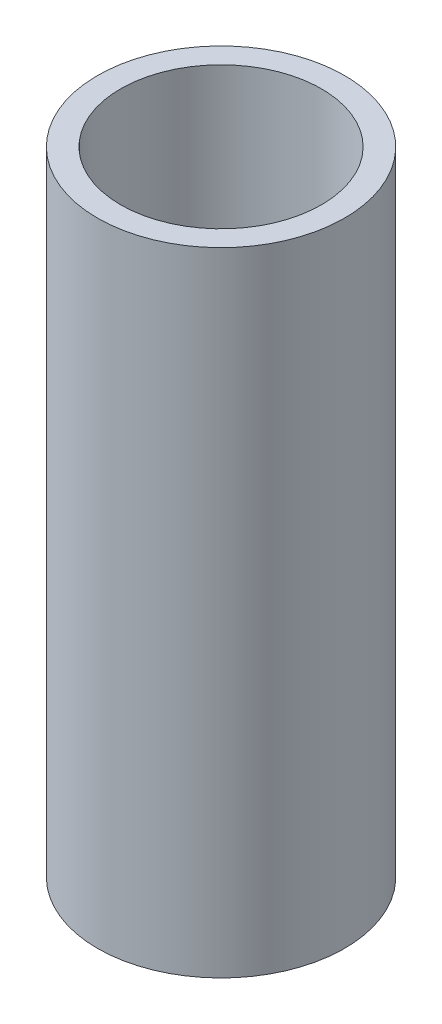
ISO-10303-21;
HEADER;
FILE_DESCRIPTION(('STEP AP214'),'2;1');
FILE_NAME('part.step','',(''),(''),'','','');
FILE_SCHEMA(('AUTOMOTIVE_DESIGN { 1 0 10303 214 1 1 1 1 }'));
ENDSEC;
DATA;
#1=APPLICATION_CONTEXT('core data for automotive mechanical design processes');
#2=APPLICATION_PROTOCOL_DEFINITION('international standard','automotive_design',2000,#1);
#3=PRODUCT_CONTEXT('',#1,'mechanical');
#4=PRODUCT('Part','Part','',(#3));
#5=PRODUCT_RELATED_PRODUCT_CATEGORY('part','',(#4));
#6=PRODUCT_DEFINITION_FORMATION('','',#4);
#7=PRODUCT_DEFINITION_CONTEXT('part definition',#1,'design');
#8=PRODUCT_DEFINITION('design','',#6,#7);
#9=PRODUCT_DEFINITION_SHAPE('','',#8);
#10=(LENGTH_UNIT() NAMED_UNIT(*) SI_UNIT(.MILLI.,.METRE.));
#11=(NAMED_UNIT(*) PLANE_ANGLE_UNIT() SI_UNIT($,.RADIAN.));
#12=(NAMED_UNIT(*) SI_UNIT($,.STERADIAN.) SOLID_ANGLE_UNIT());
#13=UNCERTAINTY_MEASURE_WITH_UNIT(LENGTH_MEASURE(1.E-05),#10,'distance_accuracy_value','');
#14=(GEOMETRIC_REPRESENTATION_CONTEXT(3) GLOBAL_UNCERTAINTY_ASSIGNED_CONTEXT((#13)) GLOBAL_UNIT_ASSIGNED_CONTEXT((#10,
#11,#12)) REPRESENTATION_CONTEXT('',''));
#15=CARTESIAN_POINT('',(0.,0.,0.));
#16=DIRECTION('',(0.,0.,1.));
#17=DIRECTION('',(1.,0.,0.));
#18=AXIS2_PLACEMENT_3D('',#15,#16,#17);
#19=CARTESIAN_POINT('',(0.,192.,0.));
#20=DIRECTION('',(0.,1.,0.));
#21=DIRECTION('',(0.,0.,1.));
#22=AXIS2_PLACEMENT_3D('',#19,#20,#21);
#23=PLANE('',#22);
#24=CARTESIAN_POINT('',(0.,192.,0.));
#25=DIRECTION('',(0.,1.,0.));
#26=DIRECTION('',(0.,0.,1.));
#27=AXIS2_PLACEMENT_3D('',#24,#25,#26);
#28=CIRCLE('',#27,37.5);
#29=CARTESIAN_POINT('',(0.,192.,37.5));
#30=VERTEX_POINT('',#29);
#31=EDGE_CURVE('E11',#30,#30,#28,.T.);
#32=ORIENTED_EDGE('',*,*,#31,.T.);
#33=EDGE_LOOP('',(#32));
#34=FACE_BOUND('',#33,.T.);
#35=CARTESIAN_POINT('',(0.,192.,0.));
#36=DIRECTION('',(0.,1.,0.));
#37=DIRECTION('',(0.,0.,1.));
#38=AXIS2_PLACEMENT_3D('',#35,#36,#37);
#39=CIRCLE('',#38,30.5);
#40=CARTESIAN_POINT('',(0.,192.,30.5));
#41=VERTEX_POINT('',#40);
#42=EDGE_CURVE('E54',#41,#41,#39,.T.);
#43=ORIENTED_EDGE('',*,*,#42,.F.);
#44=EDGE_LOOP('',(#43));
#45=FACE_BOUND('',#44,.T.);
#46=ADVANCED_FACE('F43',(#34,#45),#23,.T.);
#47=CARTESIAN_POINT('',(0.,0.,0.));
#48=DIRECTION('',(0.,1.,0.));
#49=DIRECTION('',(0.,0.,1.));
#50=AXIS2_PLACEMENT_3D('',#47,#48,#49);
#51=PLANE('',#50);
#52=CARTESIAN_POINT('',(0.,0.,0.));
#53=DIRECTION('',(0.,1.,0.));
#54=DIRECTION('',(0.,0.,1.));
#55=AXIS2_PLACEMENT_3D('',#52,#53,#54);
#56=CIRCLE('',#55,37.5);
#57=CARTESIAN_POINT('',(0.,0.,37.5));
#58=VERTEX_POINT('',#57);
#59=EDGE_CURVE('E47',#58,#58,#56,.T.);
#60=ORIENTED_EDGE('',*,*,#59,.F.);
#61=EDGE_LOOP('',(#60));
#62=FACE_BOUND('',#61,.T.);
#63=CARTESIAN_POINT('',(0.,0.,0.));
#64=DIRECTION('',(0.,1.,0.));
#65=DIRECTION('',(0.,0.,1.));
#66=AXIS2_PLACEMENT_3D('',#63,#64,#65);
#67=CIRCLE('',#66,30.5);
#68=CARTESIAN_POINT('',(0.,0.,30.5));
#69=VERTEX_POINT('',#68);
#70=EDGE_CURVE('E56',#69,#69,#67,.T.);
#71=ORIENTED_EDGE('',*,*,#70,.T.);
#72=EDGE_LOOP('',(#71));
#73=FACE_BOUND('',#72,.T.);
#74=ADVANCED_FACE('F66',(#62,#73),#51,.F.);
#75=CARTESIAN_POINT('',(0.,192.,0.));
#76=DIRECTION('',(0.,-1.,0.));
#77=DIRECTION('',(0.,0.,-1.));
#78=AXIS2_PLACEMENT_3D('',#75,#76,#77);
#79=CYLINDRICAL_SURFACE('',#78,37.5);
#80=ORIENTED_EDGE('',*,*,#31,.F.);
#81=EDGE_LOOP('',(#80));
#82=FACE_BOUND('',#81,.T.);
#83=ORIENTED_EDGE('',*,*,#59,.T.);
#84=EDGE_LOOP('',(#83));
#85=FACE_BOUND('',#84,.T.);
#86=ADVANCED_FACE('F45',(#82,#85),#79,.T.);
#87=CARTESIAN_POINT('',(0.,192.,0.));
#88=DIRECTION('',(0.,-1.,0.));
#89=DIRECTION('',(0.,0.,-1.));
#90=AXIS2_PLACEMENT_3D('',#87,#88,#89);
#91=CYLINDRICAL_SURFACE('',#90,30.5);
#92=ORIENTED_EDGE('',*,*,#42,.T.);
#93=EDGE_LOOP('',(#92));
#94=FACE_BOUND('',#93,.T.);
#95=ORIENTED_EDGE('',*,*,#70,.F.);
#96=EDGE_LOOP('',(#95));
#97=FACE_BOUND('',#96,.T.);
#98=ADVANCED_FACE('F62',(#94,#97),#91,.F.);
#99=CLOSED_SHELL('',(#46,#74,#86,#98));
#100=MANIFOLD_SOLID_BREP('B2',#99);
#101=ADVANCED_BREP_SHAPE_REPRESENTATION('',(#18,#100),#14);
#102=SHAPE_DEFINITION_REPRESENTATION(#9,#101);
ENDSEC;
END-ISO-10303-21;
